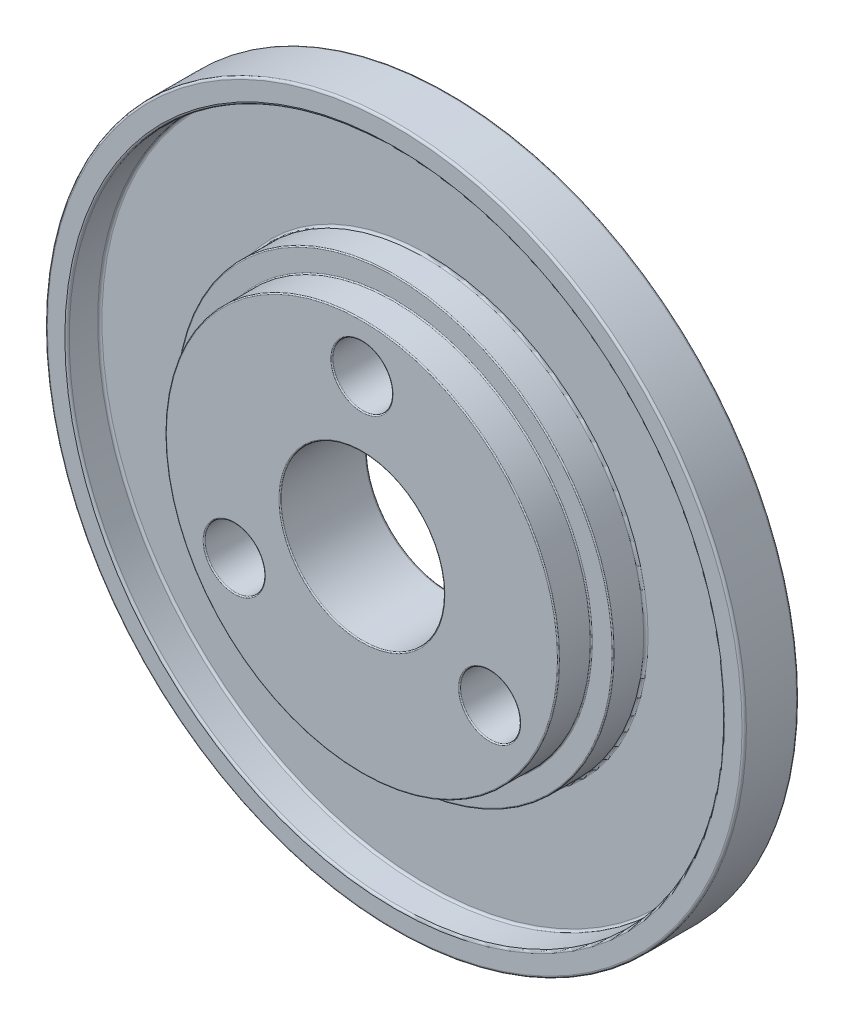
ISO-10303-21;
HEADER;
FILE_DESCRIPTION(('STEP AP214'),'2;1');
FILE_NAME('part.step','',(''),(''),'','','');
FILE_SCHEMA(('AUTOMOTIVE_DESIGN { 1 0 10303 214 1 1 1 1 }'));
ENDSEC;
DATA;
#1=APPLICATION_CONTEXT('core data for automotive mechanical design processes');
#2=APPLICATION_PROTOCOL_DEFINITION('international standard','automotive_design',2000,#1);
#3=PRODUCT_CONTEXT('',#1,'mechanical');
#4=PRODUCT('Part','Part','',(#3));
#5=PRODUCT_RELATED_PRODUCT_CATEGORY('part','',(#4));
#6=PRODUCT_DEFINITION_FORMATION('','',#4);
#7=PRODUCT_DEFINITION_CONTEXT('part definition',#1,'design');
#8=PRODUCT_DEFINITION('design','',#6,#7);
#9=PRODUCT_DEFINITION_SHAPE('','',#8);
#10=(LENGTH_UNIT() NAMED_UNIT(*) SI_UNIT(.MILLI.,.METRE.));
#11=(NAMED_UNIT(*) PLANE_ANGLE_UNIT() SI_UNIT($,.RADIAN.));
#12=(NAMED_UNIT(*) SI_UNIT($,.STERADIAN.) SOLID_ANGLE_UNIT());
#13=UNCERTAINTY_MEASURE_WITH_UNIT(LENGTH_MEASURE(1.E-05),#10,'distance_accuracy_value','');
#14=(GEOMETRIC_REPRESENTATION_CONTEXT(3) GLOBAL_UNCERTAINTY_ASSIGNED_CONTEXT((#13)) GLOBAL_UNIT_ASSIGNED_CONTEXT((#10,
#11,#12)) REPRESENTATION_CONTEXT('',''));
#15=CARTESIAN_POINT('',(0.,0.,0.));
#16=DIRECTION('',(0.,0.,1.));
#17=DIRECTION('',(1.,0.,0.));
#18=AXIS2_PLACEMENT_3D('',#15,#16,#17);
#19=CARTESIAN_POINT('',(0.,0.,0.));
#20=DIRECTION('',(0.,0.,1.));
#21=DIRECTION('',(1.,0.,0.));
#22=AXIS2_PLACEMENT_3D('',#19,#20,#21);
#23=PLANE('',#22);
#24=CARTESIAN_POINT('',(11.6913429510899,-6.75,0.));
#25=DIRECTION('',(0.,0.,-1.));
#26=DIRECTION('',(-1.,0.,0.));
#27=AXIS2_PLACEMENT_3D('',#24,#25,#26);
#28=CIRCLE('',#27,5.6);
#29=CARTESIAN_POINT('',(6.09134295108992,-6.75,0.));
#30=VERTEX_POINT('',#29);
#31=EDGE_CURVE('E131',#30,#30,#28,.T.);
#32=ORIENTED_EDGE('',*,*,#31,.F.);
#33=EDGE_LOOP('',(#32));
#34=FACE_BOUND('',#33,.T.);
#35=CARTESIAN_POINT('',(-11.6913429510899,-6.75,0.));
#36=DIRECTION('',(0.,0.,-1.));
#37=DIRECTION('',(-1.,0.,0.));
#38=AXIS2_PLACEMENT_3D('',#35,#36,#37);
#39=CIRCLE('',#38,5.6);
#40=CARTESIAN_POINT('',(-17.2913429510899,-6.75,0.));
#41=VERTEX_POINT('',#40);
#42=EDGE_CURVE('E125',#41,#41,#39,.T.);
#43=ORIENTED_EDGE('',*,*,#42,.F.);
#44=EDGE_LOOP('',(#43));
#45=FACE_BOUND('',#44,.T.);
#46=CARTESIAN_POINT('',(0.,0.,0.));
#47=DIRECTION('',(0.,0.,1.));
#48=DIRECTION('',(1.,0.,0.));
#49=AXIS2_PLACEMENT_3D('',#46,#47,#48);
#50=CIRCLE('',#49,31.8);
#51=CARTESIAN_POINT('',(31.8,0.,0.));
#52=VERTEX_POINT('',#51);
#53=EDGE_CURVE('E86',#52,#52,#50,.F.);
#54=ORIENTED_EDGE('',*,*,#53,.T.);
#55=EDGE_LOOP('',(#54));
#56=FACE_BOUND('',#55,.T.);
#57=CARTESIAN_POINT('',(0.,0.,0.));
#58=DIRECTION('',(0.,0.,1.));
#59=DIRECTION('',(1.,0.,0.));
#60=AXIS2_PLACEMENT_3D('',#57,#58,#59);
#61=CIRCLE('',#60,7.7);
#62=CARTESIAN_POINT('',(7.7,0.,0.));
#63=VERTEX_POINT('',#62);
#64=EDGE_CURVE('E83',#63,#63,#61,.T.);
#65=ORIENTED_EDGE('',*,*,#64,.T.);
#66=EDGE_LOOP('',(#65));
#67=FACE_BOUND('',#66,.T.);
#68=CARTESIAN_POINT('',(0.,13.5,0.));
#69=DIRECTION('',(0.,0.,-1.));
#70=DIRECTION('',(-1.,0.,0.));
#71=AXIS2_PLACEMENT_3D('',#68,#69,#70);
#72=CIRCLE('',#71,5.6);
#73=CARTESIAN_POINT('',(-5.6,13.5,0.));
#74=VERTEX_POINT('',#73);
#75=EDGE_CURVE('E119',#74,#74,#72,.T.);
#76=ORIENTED_EDGE('',*,*,#75,.F.);
#77=EDGE_LOOP('',(#76));
#78=FACE_BOUND('',#77,.T.);
#79=ADVANCED_FACE('F30',(#34,#45,#56,#67,#78),#23,.F.);
#80=CARTESIAN_POINT('',(0.,0.,5.));
#81=DIRECTION('',(0.,0.,1.));
#82=DIRECTION('',(1.,0.,0.));
#83=AXIS2_PLACEMENT_3D('',#80,#81,#82);
#84=PLANE('',#83);
#85=CARTESIAN_POINT('',(0.,0.,5.));
#86=DIRECTION('',(0.,0.,1.));
#87=DIRECTION('',(1.,0.,0.));
#88=AXIS2_PLACEMENT_3D('',#85,#86,#87);
#89=CIRCLE('',#88,19.9);
#90=CARTESIAN_POINT('',(19.9,0.,5.));
#91=VERTEX_POINT('',#90);
#92=EDGE_CURVE('E74',#91,#91,#89,.T.);
#93=ORIENTED_EDGE('',*,*,#92,.T.);
#94=EDGE_LOOP('',(#93));
#95=FACE_BOUND('',#94,.T.);
#96=CARTESIAN_POINT('',(0.,0.,5.));
#97=DIRECTION('',(0.,0.,1.));
#98=DIRECTION('',(1.,0.,0.));
#99=AXIS2_PLACEMENT_3D('',#96,#97,#98);
#100=CIRCLE('',#99,18.1);
#101=CARTESIAN_POINT('',(18.1,0.,5.));
#102=VERTEX_POINT('',#101);
#103=EDGE_CURVE('E77',#102,#102,#100,.F.);
#104=ORIENTED_EDGE('',*,*,#103,.T.);
#105=EDGE_LOOP('',(#104));
#106=FACE_BOUND('',#105,.T.);
#107=ADVANCED_FACE('F139',(#95,#106),#84,.T.);
#108=CARTESIAN_POINT('',(0.,0.,5.));
#109=DIRECTION('',(0.,0.,1.));
#110=DIRECTION('',(1.,0.,0.));
#111=AXIS2_PLACEMENT_3D('',#108,#109,#110);
#112=CIRCLE('',#111,31.8);
#113=CARTESIAN_POINT('',(31.8,0.,5.));
#114=VERTEX_POINT('',#113);
#115=EDGE_CURVE('E95',#114,#114,#112,.T.);
#116=ORIENTED_EDGE('',*,*,#115,.T.);
#117=EDGE_LOOP('',(#116));
#118=FACE_BOUND('',#117,.T.);
#119=CARTESIAN_POINT('',(0.,0.,5.));
#120=DIRECTION('',(0.,0.,1.));
#121=DIRECTION('',(1.,0.,0.));
#122=AXIS2_PLACEMENT_3D('',#119,#120,#121);
#123=CIRCLE('',#122,30.2);
#124=CARTESIAN_POINT('',(30.2,0.,5.));
#125=VERTEX_POINT('',#124);
#126=EDGE_CURVE('E98',#125,#125,#123,.F.);
#127=ORIENTED_EDGE('',*,*,#126,.T.);
#128=EDGE_LOOP('',(#127));
#129=FACE_BOUND('',#128,.T.);
#130=ADVANCED_FACE('F199',(#118,#129),#84,.T.);
#131=CARTESIAN_POINT('',(0.,0.,5.));
#132=DIRECTION('',(0.,0.,-1.));
#133=DIRECTION('',(-1.,0.,0.));
#134=AXIS2_PLACEMENT_3D('',#131,#132,#133);
#135=CYLINDRICAL_SURFACE('',#134,32.);
#136=CARTESIAN_POINT('',(0.,0.,4.8));
#137=DIRECTION('',(0.,0.,1.));
#138=DIRECTION('',(1.,0.,0.));
#139=AXIS2_PLACEMENT_3D('',#136,#137,#138);
#140=CIRCLE('',#139,32.);
#141=CARTESIAN_POINT('',(32.,0.,4.8));
#142=VERTEX_POINT('',#141);
#143=EDGE_CURVE('E89',#142,#142,#140,.F.);
#144=ORIENTED_EDGE('',*,*,#143,.T.);
#145=EDGE_LOOP('',(#144));
#146=FACE_BOUND('',#145,.T.);
#147=CARTESIAN_POINT('',(0.,0.,0.2));
#148=DIRECTION('',(0.,0.,1.));
#149=DIRECTION('',(1.,0.,0.));
#150=AXIS2_PLACEMENT_3D('',#147,#148,#149);
#151=CIRCLE('',#150,32.);
#152=CARTESIAN_POINT('',(32.,0.,0.2));
#153=VERTEX_POINT('',#152);
#154=EDGE_CURVE('E92',#153,#153,#151,.T.);
#155=ORIENTED_EDGE('',*,*,#154,.T.);
#156=EDGE_LOOP('',(#155));
#157=FACE_BOUND('',#156,.T.);
#158=ADVANCED_FACE('F198',(#146,#157),#135,.T.);
#159=CARTESIAN_POINT('',(0.,0.,5.));
#160=DIRECTION('',(0.,0.,-1.));
#161=DIRECTION('',(-1.,0.,0.));
#162=AXIS2_PLACEMENT_3D('',#159,#160,#161);
#163=CYLINDRICAL_SURFACE('',#162,7.5);
#164=CARTESIAN_POINT('',(0.,0.,7.9));
#165=DIRECTION('',(0.,0.,1.));
#166=DIRECTION('',(1.,0.,0.));
#167=AXIS2_PLACEMENT_3D('',#164,#165,#166);
#168=CIRCLE('',#167,7.5);
#169=CARTESIAN_POINT('',(7.5,0.,7.9));
#170=VERTEX_POINT('',#169);
#171=EDGE_CURVE('E10',#170,#170,#168,.T.);
#172=ORIENTED_EDGE('',*,*,#171,.T.);
#173=EDGE_LOOP('',(#172));
#174=FACE_BOUND('',#173,.T.);
#175=CARTESIAN_POINT('',(0.,0.,0.2));
#176=DIRECTION('',(0.,0.,1.));
#177=DIRECTION('',(1.,0.,0.));
#178=AXIS2_PLACEMENT_3D('',#175,#176,#177);
#179=CIRCLE('',#178,7.5);
#180=CARTESIAN_POINT('',(7.5,0.,0.2));
#181=VERTEX_POINT('',#180);
#182=EDGE_CURVE('E80',#181,#181,#179,.F.);
#183=ORIENTED_EDGE('',*,*,#182,.T.);
#184=EDGE_LOOP('',(#183));
#185=FACE_BOUND('',#184,.T.);
#186=ADVANCED_FACE('F194',(#174,#185),#163,.F.);
#187=CARTESIAN_POINT('',(0.,0.,2.));
#188=DIRECTION('',(0.,0.,1.));
#189=DIRECTION('',(1.,0.,0.));
#190=AXIS2_PLACEMENT_3D('',#187,#188,#189);
#191=CYLINDRICAL_SURFACE('',#190,30.);
#192=CARTESIAN_POINT('',(0.,0.,2.2));
#193=DIRECTION('',(0.,0.,1.));
#194=DIRECTION('',(1.,0.,0.));
#195=AXIS2_PLACEMENT_3D('',#192,#193,#194);
#196=CIRCLE('',#195,30.);
#197=CARTESIAN_POINT('',(30.,0.,2.2));
#198=VERTEX_POINT('',#197);
#199=EDGE_CURVE('E104',#198,#198,#196,.F.);
#200=ORIENTED_EDGE('',*,*,#199,.T.);
#201=EDGE_LOOP('',(#200));
#202=FACE_BOUND('',#201,.T.);
#203=CARTESIAN_POINT('',(0.,0.,4.8));
#204=DIRECTION('',(0.,0.,1.));
#205=DIRECTION('',(1.,0.,0.));
#206=AXIS2_PLACEMENT_3D('',#203,#204,#205);
#207=CIRCLE('',#206,30.);
#208=CARTESIAN_POINT('',(30.,0.,4.8));
#209=VERTEX_POINT('',#208);
#210=EDGE_CURVE('E107',#209,#209,#207,.T.);
#211=ORIENTED_EDGE('',*,*,#210,.T.);
#212=EDGE_LOOP('',(#211));
#213=FACE_BOUND('',#212,.T.);
#214=ADVANCED_FACE('F190',(#202,#213),#191,.F.);
#215=CARTESIAN_POINT('',(0.,0.,2.));
#216=DIRECTION('',(0.,0.,1.));
#217=DIRECTION('',(1.,0.,0.));
#218=AXIS2_PLACEMENT_3D('',#215,#216,#217);
#219=PLANE('',#218);
#220=CARTESIAN_POINT('',(0.,0.,2.));
#221=DIRECTION('',(0.,0.,1.));
#222=DIRECTION('',(1.,0.,0.));
#223=AXIS2_PLACEMENT_3D('',#220,#221,#222);
#224=CIRCLE('',#223,29.8);
#225=CARTESIAN_POINT('',(29.8,0.,2.));
#226=VERTEX_POINT('',#225);
#227=EDGE_CURVE('E110',#226,#226,#224,.T.);
#228=ORIENTED_EDGE('',*,*,#227,.T.);
#229=EDGE_LOOP('',(#228));
#230=FACE_BOUND('',#229,.T.);
#231=CARTESIAN_POINT('',(0.,0.,2.));
#232=DIRECTION('',(0.,0.,1.));
#233=DIRECTION('',(1.,0.,0.));
#234=AXIS2_PLACEMENT_3D('',#231,#232,#233);
#235=CIRCLE('',#234,20.2);
#236=CARTESIAN_POINT('',(20.2,0.,2.));
#237=VERTEX_POINT('',#236);
#238=EDGE_CURVE('E113',#237,#237,#235,.F.);
#239=ORIENTED_EDGE('',*,*,#238,.T.);
#240=EDGE_LOOP('',(#239));
#241=FACE_BOUND('',#240,.T.);
#242=ADVANCED_FACE('F186',(#230,#241),#219,.T.);
#243=CARTESIAN_POINT('',(0.,0.,2.));
#244=DIRECTION('',(0.,0.,1.));
#245=DIRECTION('',(1.,0.,0.));
#246=AXIS2_PLACEMENT_3D('',#243,#244,#245);
#247=CYLINDRICAL_SURFACE('',#246,20.);
#248=CARTESIAN_POINT('',(0.,0.,4.9));
#249=DIRECTION('',(0.,0.,1.));
#250=DIRECTION('',(1.,0.,0.));
#251=AXIS2_PLACEMENT_3D('',#248,#249,#250);
#252=CIRCLE('',#251,20.);
#253=CARTESIAN_POINT('',(20.,0.,4.9));
#254=VERTEX_POINT('',#253);
#255=EDGE_CURVE('E71',#254,#254,#252,.F.);
#256=ORIENTED_EDGE('',*,*,#255,.T.);
#257=EDGE_LOOP('',(#256));
#258=FACE_BOUND('',#257,.T.);
#259=CARTESIAN_POINT('',(0.,0.,2.2));
#260=DIRECTION('',(0.,0.,1.));
#261=DIRECTION('',(1.,0.,0.));
#262=AXIS2_PLACEMENT_3D('',#259,#260,#261);
#263=CIRCLE('',#262,20.);
#264=CARTESIAN_POINT('',(20.,0.,2.2));
#265=VERTEX_POINT('',#264);
#266=EDGE_CURVE('E101',#265,#265,#263,.T.);
#267=ORIENTED_EDGE('',*,*,#266,.T.);
#268=EDGE_LOOP('',(#267));
#269=FACE_BOUND('',#268,.T.);
#270=ADVANCED_FACE('F182',(#258,#269),#247,.T.);
#271=CARTESIAN_POINT('',(0.,0.,2.2));
#272=DIRECTION('',(0.,0.,1.));
#273=DIRECTION('',(1.,0.,0.));
#274=AXIS2_PLACEMENT_3D('',#271,#272,#273);
#275=TOROIDAL_SURFACE('',#274,29.8,0.2);
#276=ORIENTED_EDGE('',*,*,#199,.F.);
#277=EDGE_LOOP('',(#276));
#278=FACE_BOUND('',#277,.T.);
#279=ORIENTED_EDGE('',*,*,#227,.F.);
#280=EDGE_LOOP('',(#279));
#281=FACE_BOUND('',#280,.T.);
#282=ADVANCED_FACE('F185',(#278,#281),#275,.F.);
#283=CARTESIAN_POINT('',(0.,0.,2.2));
#284=DIRECTION('',(0.,0.,1.));
#285=DIRECTION('',(1.,0.,0.));
#286=AXIS2_PLACEMENT_3D('',#283,#284,#285);
#287=TOROIDAL_SURFACE('',#286,20.2,0.2);
#288=ORIENTED_EDGE('',*,*,#238,.F.);
#289=EDGE_LOOP('',(#288));
#290=FACE_BOUND('',#289,.T.);
#291=ORIENTED_EDGE('',*,*,#266,.F.);
#292=EDGE_LOOP('',(#291));
#293=FACE_BOUND('',#292,.T.);
#294=ADVANCED_FACE('F208',(#290,#293),#287,.F.);
#295=CARTESIAN_POINT('',(0.,0.,4.8));
#296=DIRECTION('',(0.,0.,1.));
#297=DIRECTION('',(1.,0.,0.));
#298=AXIS2_PLACEMENT_3D('',#295,#296,#297);
#299=TOROIDAL_SURFACE('',#298,31.8,0.2);
#300=ORIENTED_EDGE('',*,*,#143,.F.);
#301=EDGE_LOOP('',(#300));
#302=FACE_BOUND('',#301,.T.);
#303=ORIENTED_EDGE('',*,*,#115,.F.);
#304=EDGE_LOOP('',(#303));
#305=FACE_BOUND('',#304,.T.);
#306=ADVANCED_FACE('F212',(#302,#305),#299,.T.);
#307=CARTESIAN_POINT('',(0.,0.,4.8));
#308=DIRECTION('',(0.,0.,1.));
#309=DIRECTION('',(1.,0.,0.));
#310=AXIS2_PLACEMENT_3D('',#307,#308,#309);
#311=TOROIDAL_SURFACE('',#310,30.2,0.2);
#312=ORIENTED_EDGE('',*,*,#126,.F.);
#313=EDGE_LOOP('',(#312));
#314=FACE_BOUND('',#313,.T.);
#315=ORIENTED_EDGE('',*,*,#210,.F.);
#316=EDGE_LOOP('',(#315));
#317=FACE_BOUND('',#316,.T.);
#318=ADVANCED_FACE('F216',(#314,#317),#311,.T.);
#319=CARTESIAN_POINT('',(0.,0.,0.2));
#320=DIRECTION('',(0.,0.,1.));
#321=DIRECTION('',(1.,0.,0.));
#322=AXIS2_PLACEMENT_3D('',#319,#320,#321);
#323=TOROIDAL_SURFACE('',#322,7.7,0.2);
#324=ORIENTED_EDGE('',*,*,#182,.F.);
#325=EDGE_LOOP('',(#324));
#326=FACE_BOUND('',#325,.T.);
#327=ORIENTED_EDGE('',*,*,#64,.F.);
#328=EDGE_LOOP('',(#327));
#329=FACE_BOUND('',#328,.T.);
#330=ADVANCED_FACE('F220',(#326,#329),#323,.T.);
#331=CARTESIAN_POINT('',(0.,0.,0.2));
#332=DIRECTION('',(0.,0.,1.));
#333=DIRECTION('',(1.,0.,0.));
#334=AXIS2_PLACEMENT_3D('',#331,#332,#333);
#335=TOROIDAL_SURFACE('',#334,31.8,0.2);
#336=ORIENTED_EDGE('',*,*,#53,.F.);
#337=EDGE_LOOP('',(#336));
#338=FACE_BOUND('',#337,.T.);
#339=ORIENTED_EDGE('',*,*,#154,.F.);
#340=EDGE_LOOP('',(#339));
#341=FACE_BOUND('',#340,.T.);
#342=ADVANCED_FACE('F177',(#338,#341),#335,.T.);
#343=CARTESIAN_POINT('',(0.,0.,8.));
#344=DIRECTION('',(0.,0.,1.));
#345=DIRECTION('',(1.,0.,0.));
#346=AXIS2_PLACEMENT_3D('',#343,#344,#345);
#347=PLANE('',#346);
#348=CARTESIAN_POINT('',(0.,0.,8.));
#349=DIRECTION('',(0.,0.,1.));
#350=DIRECTION('',(1.,0.,0.));
#351=AXIS2_PLACEMENT_3D('',#348,#349,#350);
#352=CIRCLE('',#351,17.9);
#353=CARTESIAN_POINT('',(17.9,0.,8.));
#354=VERTEX_POINT('',#353);
#355=EDGE_CURVE('E50',#354,#354,#352,.T.);
#356=ORIENTED_EDGE('',*,*,#355,.T.);
#357=EDGE_LOOP('',(#356));
#358=FACE_BOUND('',#357,.T.);
#359=CARTESIAN_POINT('',(-11.6913429510899,-6.75,8.));
#360=DIRECTION('',(0.,0.,1.));
#361=DIRECTION('',(1.,0.,0.));
#362=AXIS2_PLACEMENT_3D('',#359,#360,#361);
#363=CIRCLE('',#362,2.85);
#364=CARTESIAN_POINT('',(-8.84134295108992,-6.75,8.));
#365=VERTEX_POINT('',#364);
#366=EDGE_CURVE('E53',#365,#365,#363,.F.);
#367=ORIENTED_EDGE('',*,*,#366,.T.);
#368=EDGE_LOOP('',(#367));
#369=FACE_BOUND('',#368,.T.);
#370=CARTESIAN_POINT('',(0.,13.5,8.));
#371=DIRECTION('',(0.,0.,1.));
#372=DIRECTION('',(1.,0.,0.));
#373=AXIS2_PLACEMENT_3D('',#370,#371,#372);
#374=CIRCLE('',#373,2.85);
#375=CARTESIAN_POINT('',(2.85,13.5,8.));
#376=VERTEX_POINT('',#375);
#377=EDGE_CURVE('E56',#376,#376,#374,.F.);
#378=ORIENTED_EDGE('',*,*,#377,.T.);
#379=EDGE_LOOP('',(#378));
#380=FACE_BOUND('',#379,.T.);
#381=CARTESIAN_POINT('',(11.6913429510899,-6.75,8.));
#382=DIRECTION('',(0.,0.,1.));
#383=DIRECTION('',(1.,0.,0.));
#384=AXIS2_PLACEMENT_3D('',#381,#382,#383);
#385=CIRCLE('',#384,2.85);
#386=CARTESIAN_POINT('',(14.5413429510899,-6.75,8.));
#387=VERTEX_POINT('',#386);
#388=EDGE_CURVE('E59',#387,#387,#385,.F.);
#389=ORIENTED_EDGE('',*,*,#388,.T.);
#390=EDGE_LOOP('',(#389));
#391=FACE_BOUND('',#390,.T.);
#392=CARTESIAN_POINT('',(0.,0.,8.));
#393=DIRECTION('',(0.,0.,1.));
#394=DIRECTION('',(1.,0.,0.));
#395=AXIS2_PLACEMENT_3D('',#392,#393,#394);
#396=CIRCLE('',#395,7.6);
#397=CARTESIAN_POINT('',(7.6,0.,8.));
#398=VERTEX_POINT('',#397);
#399=EDGE_CURVE('E62',#398,#398,#396,.F.);
#400=ORIENTED_EDGE('',*,*,#399,.T.);
#401=EDGE_LOOP('',(#400));
#402=FACE_BOUND('',#401,.T.);
#403=ADVANCED_FACE('F174',(#358,#369,#380,#391,#402),#347,.T.);
#404=CARTESIAN_POINT('',(0.,0.,8.));
#405=DIRECTION('',(0.,0.,-1.));
#406=DIRECTION('',(-1.,0.,0.));
#407=AXIS2_PLACEMENT_3D('',#404,#405,#406);
#408=CYLINDRICAL_SURFACE('',#407,18.);
#409=CARTESIAN_POINT('',(0.,0.,5.1));
#410=DIRECTION('',(0.,0.,1.));
#411=DIRECTION('',(1.,0.,0.));
#412=AXIS2_PLACEMENT_3D('',#409,#410,#411);
#413=CIRCLE('',#412,18.);
#414=CARTESIAN_POINT('',(18.,0.,5.1));
#415=VERTEX_POINT('',#414);
#416=EDGE_CURVE('E65',#415,#415,#413,.T.);
#417=ORIENTED_EDGE('',*,*,#416,.T.);
#418=EDGE_LOOP('',(#417));
#419=FACE_BOUND('',#418,.T.);
#420=CARTESIAN_POINT('',(0.,0.,7.9));
#421=DIRECTION('',(0.,0.,1.));
#422=DIRECTION('',(1.,0.,0.));
#423=AXIS2_PLACEMENT_3D('',#420,#421,#422);
#424=CIRCLE('',#423,18.);
#425=CARTESIAN_POINT('',(18.,0.,7.9));
#426=VERTEX_POINT('',#425);
#427=EDGE_CURVE('E68',#426,#426,#424,.F.);
#428=ORIENTED_EDGE('',*,*,#427,.T.);
#429=EDGE_LOOP('',(#428));
#430=FACE_BOUND('',#429,.T.);
#431=ADVANCED_FACE('F172',(#419,#430),#408,.T.);
#432=CARTESIAN_POINT('',(0.,13.5,-7.77817459305202));
#433=DIRECTION('',(0.,0.,1.));
#434=DIRECTION('',(1.,0.,0.));
#435=AXIS2_PLACEMENT_3D('',#432,#433,#434);
#436=CYLINDRICAL_SURFACE('',#435,2.75);
#437=CARTESIAN_POINT('',(0.,13.5,7.9));
#438=DIRECTION('',(0.,0.,1.));
#439=DIRECTION('',(1.,0.,0.));
#440=AXIS2_PLACEMENT_3D('',#437,#438,#439);
#441=CIRCLE('',#440,2.75);
#442=CARTESIAN_POINT('',(2.75,13.5,7.9));
#443=VERTEX_POINT('',#442);
#444=EDGE_CURVE('E41',#443,#443,#441,.T.);
#445=ORIENTED_EDGE('',*,*,#444,.T.);
#446=EDGE_LOOP('',(#445));
#447=FACE_BOUND('',#446,.T.);
#448=CARTESIAN_POINT('',(0.,13.5,2.84999999999999));
#449=DIRECTION('',(0.,0.,-1.));
#450=DIRECTION('',(-1.,0.,0.));
#451=AXIS2_PLACEMENT_3D('',#448,#449,#450);
#452=CIRCLE('',#451,2.74999999999999);
#453=CARTESIAN_POINT('',(-2.74999999999999,13.5,2.84999999999999));
#454=VERTEX_POINT('',#453);
#455=EDGE_CURVE('E116',#454,#454,#452,.T.);
#456=ORIENTED_EDGE('',*,*,#455,.T.);
#457=EDGE_LOOP('',(#456));
#458=FACE_BOUND('',#457,.T.);
#459=ADVANCED_FACE('F168',(#447,#458),#436,.F.);
#460=CARTESIAN_POINT('',(-11.6913429510899,-6.75,-7.77817459305202));
#461=DIRECTION('',(0.,0.,1.));
#462=DIRECTION('',(1.,0.,0.));
#463=AXIS2_PLACEMENT_3D('',#460,#461,#462);
#464=CYLINDRICAL_SURFACE('',#463,2.75);
#465=CARTESIAN_POINT('',(-11.6913429510899,-6.75,7.9));
#466=DIRECTION('',(0.,0.,1.));
#467=DIRECTION('',(1.,0.,0.));
#468=AXIS2_PLACEMENT_3D('',#465,#466,#467);
#469=CIRCLE('',#468,2.75);
#470=CARTESIAN_POINT('',(-8.94134295108992,-6.75,7.9));
#471=VERTEX_POINT('',#470);
#472=EDGE_CURVE('E45',#471,#471,#469,.T.);
#473=ORIENTED_EDGE('',*,*,#472,.T.);
#474=EDGE_LOOP('',(#473));
#475=FACE_BOUND('',#474,.T.);
#476=CARTESIAN_POINT('',(-11.6913429510899,-6.75,2.84999999999999));
#477=DIRECTION('',(0.,0.,-1.));
#478=DIRECTION('',(-1.,0.,0.));
#479=AXIS2_PLACEMENT_3D('',#476,#477,#478);
#480=CIRCLE('',#479,2.74999999999999);
#481=CARTESIAN_POINT('',(-14.4413429510899,-6.75,2.84999999999999));
#482=VERTEX_POINT('',#481);
#483=EDGE_CURVE('E122',#482,#482,#480,.T.);
#484=ORIENTED_EDGE('',*,*,#483,.T.);
#485=EDGE_LOOP('',(#484));
#486=FACE_BOUND('',#485,.T.);
#487=ADVANCED_FACE('F161',(#475,#486),#464,.F.);
#488=CARTESIAN_POINT('',(11.6913429510899,-6.75,-7.77817459305202));
#489=DIRECTION('',(0.,0.,1.));
#490=DIRECTION('',(1.,0.,0.));
#491=AXIS2_PLACEMENT_3D('',#488,#489,#490);
#492=CYLINDRICAL_SURFACE('',#491,2.75);
#493=CARTESIAN_POINT('',(11.6913429510899,-6.75,7.9));
#494=DIRECTION('',(0.,0.,1.));
#495=DIRECTION('',(1.,0.,0.));
#496=AXIS2_PLACEMENT_3D('',#493,#494,#495);
#497=CIRCLE('',#496,2.75);
#498=CARTESIAN_POINT('',(14.4413429510899,-6.75,7.9));
#499=VERTEX_POINT('',#498);
#500=EDGE_CURVE('E37',#499,#499,#497,.T.);
#501=ORIENTED_EDGE('',*,*,#500,.T.);
#502=EDGE_LOOP('',(#501));
#503=FACE_BOUND('',#502,.T.);
#504=CARTESIAN_POINT('',(11.6913429510899,-6.75,2.84999999999999));
#505=DIRECTION('',(0.,0.,-1.));
#506=DIRECTION('',(-1.,0.,0.));
#507=AXIS2_PLACEMENT_3D('',#504,#505,#506);
#508=CIRCLE('',#507,2.74999999999999);
#509=CARTESIAN_POINT('',(8.94134295108993,-6.75,2.84999999999999));
#510=VERTEX_POINT('',#509);
#511=EDGE_CURVE('E128',#510,#510,#508,.T.);
#512=ORIENTED_EDGE('',*,*,#511,.T.);
#513=EDGE_LOOP('',(#512));
#514=FACE_BOUND('',#513,.T.);
#515=ADVANCED_FACE('F152',(#503,#514),#492,.F.);
#516=CARTESIAN_POINT('',(0.,13.5,0.));
#517=DIRECTION('',(0.,0.,-1.));
#518=DIRECTION('',(-1.,0.,0.));
#519=AXIS2_PLACEMENT_3D('',#516,#517,#518);
#520=CONICAL_SURFACE('',#519,5.6,0.785398163397452);
#521=ORIENTED_EDGE('',*,*,#455,.F.);
#522=EDGE_LOOP('',(#521));
#523=FACE_BOUND('',#522,.T.);
#524=ORIENTED_EDGE('',*,*,#75,.T.);
#525=EDGE_LOOP('',(#524));
#526=FACE_BOUND('',#525,.T.);
#527=ADVANCED_FACE('F149',(#523,#526),#520,.F.);
#528=CARTESIAN_POINT('',(-11.6913429510899,-6.75,0.));
#529=DIRECTION('',(0.,0.,-1.));
#530=DIRECTION('',(-1.,0.,0.));
#531=AXIS2_PLACEMENT_3D('',#528,#529,#530);
#532=CONICAL_SURFACE('',#531,5.6,0.785398163397452);
#533=ORIENTED_EDGE('',*,*,#483,.F.);
#534=EDGE_LOOP('',(#533));
#535=FACE_BOUND('',#534,.T.);
#536=ORIENTED_EDGE('',*,*,#42,.T.);
#537=EDGE_LOOP('',(#536));
#538=FACE_BOUND('',#537,.T.);
#539=ADVANCED_FACE('F151',(#535,#538),#532,.F.);
#540=CARTESIAN_POINT('',(11.6913429510899,-6.75,0.));
#541=DIRECTION('',(0.,0.,-1.));
#542=DIRECTION('',(-1.,0.,0.));
#543=AXIS2_PLACEMENT_3D('',#540,#541,#542);
#544=CONICAL_SURFACE('',#543,5.6,0.785398163397452);
#545=ORIENTED_EDGE('',*,*,#511,.F.);
#546=EDGE_LOOP('',(#545));
#547=FACE_BOUND('',#546,.T.);
#548=ORIENTED_EDGE('',*,*,#31,.T.);
#549=EDGE_LOOP('',(#548));
#550=FACE_BOUND('',#549,.T.);
#551=ADVANCED_FACE('F135',(#547,#550),#544,.F.);
#552=CARTESIAN_POINT('',(0.,0.,4.9));
#553=DIRECTION('',(0.,0.,1.));
#554=DIRECTION('',(1.,0.,0.));
#555=AXIS2_PLACEMENT_3D('',#552,#553,#554);
#556=TOROIDAL_SURFACE('',#555,19.9,0.1);
#557=ORIENTED_EDGE('',*,*,#255,.F.);
#558=EDGE_LOOP('',(#557));
#559=FACE_BOUND('',#558,.T.);
#560=ORIENTED_EDGE('',*,*,#92,.F.);
#561=EDGE_LOOP('',(#560));
#562=FACE_BOUND('',#561,.T.);
#563=ADVANCED_FACE('F228',(#559,#562),#556,.T.);
#564=CARTESIAN_POINT('',(0.,0.,5.1));
#565=DIRECTION('',(0.,0.,1.));
#566=DIRECTION('',(1.,0.,0.));
#567=AXIS2_PLACEMENT_3D('',#564,#565,#566);
#568=TOROIDAL_SURFACE('',#567,18.1,0.1);
#569=ORIENTED_EDGE('',*,*,#103,.F.);
#570=EDGE_LOOP('',(#569));
#571=FACE_BOUND('',#570,.T.);
#572=ORIENTED_EDGE('',*,*,#416,.F.);
#573=EDGE_LOOP('',(#572));
#574=FACE_BOUND('',#573,.T.);
#575=ADVANCED_FACE('F231',(#571,#574),#568,.F.);
#576=CARTESIAN_POINT('',(0.,0.,7.9));
#577=DIRECTION('',(0.,0.,1.));
#578=DIRECTION('',(1.,0.,0.));
#579=AXIS2_PLACEMENT_3D('',#576,#577,#578);
#580=TOROIDAL_SURFACE('',#579,17.9,0.1);
#581=ORIENTED_EDGE('',*,*,#427,.F.);
#582=EDGE_LOOP('',(#581));
#583=FACE_BOUND('',#582,.T.);
#584=ORIENTED_EDGE('',*,*,#355,.F.);
#585=EDGE_LOOP('',(#584));
#586=FACE_BOUND('',#585,.T.);
#587=ADVANCED_FACE('F235',(#583,#586),#580,.T.);
#588=CARTESIAN_POINT('',(-11.6913429510899,-6.75,7.9));
#589=DIRECTION('',(0.,0.,1.));
#590=DIRECTION('',(1.,0.,0.));
#591=AXIS2_PLACEMENT_3D('',#588,#589,#590);
#592=TOROIDAL_SURFACE('',#591,2.85,0.1);
#593=ORIENTED_EDGE('',*,*,#366,.F.);
#594=EDGE_LOOP('',(#593));
#595=FACE_BOUND('',#594,.T.);
#596=ORIENTED_EDGE('',*,*,#472,.F.);
#597=EDGE_LOOP('',(#596));
#598=FACE_BOUND('',#597,.T.);
#599=ADVANCED_FACE('F239',(#595,#598),#592,.T.);
#600=CARTESIAN_POINT('',(0.,13.5,7.9));
#601=DIRECTION('',(0.,0.,1.));
#602=DIRECTION('',(1.,0.,0.));
#603=AXIS2_PLACEMENT_3D('',#600,#601,#602);
#604=TOROIDAL_SURFACE('',#603,2.85,0.1);
#605=ORIENTED_EDGE('',*,*,#377,.F.);
#606=EDGE_LOOP('',(#605));
#607=FACE_BOUND('',#606,.T.);
#608=ORIENTED_EDGE('',*,*,#444,.F.);
#609=EDGE_LOOP('',(#608));
#610=FACE_BOUND('',#609,.T.);
#611=ADVANCED_FACE('F243',(#607,#610),#604,.T.);
#612=CARTESIAN_POINT('',(11.6913429510899,-6.75,7.9));
#613=DIRECTION('',(0.,0.,1.));
#614=DIRECTION('',(1.,0.,0.));
#615=AXIS2_PLACEMENT_3D('',#612,#613,#614);
#616=TOROIDAL_SURFACE('',#615,2.85,0.1);
#617=ORIENTED_EDGE('',*,*,#388,.F.);
#618=EDGE_LOOP('',(#617));
#619=FACE_BOUND('',#618,.T.);
#620=ORIENTED_EDGE('',*,*,#500,.F.);
#621=EDGE_LOOP('',(#620));
#622=FACE_BOUND('',#621,.T.);
#623=ADVANCED_FACE('F246',(#619,#622),#616,.T.);
#624=CARTESIAN_POINT('',(0.,0.,7.9));
#625=DIRECTION('',(0.,0.,1.));
#626=DIRECTION('',(1.,0.,0.));
#627=AXIS2_PLACEMENT_3D('',#624,#625,#626);
#628=TOROIDAL_SURFACE('',#627,7.6,0.1);
#629=ORIENTED_EDGE('',*,*,#399,.F.);
#630=EDGE_LOOP('',(#629));
#631=FACE_BOUND('',#630,.T.);
#632=ORIENTED_EDGE('',*,*,#171,.F.);
#633=EDGE_LOOP('',(#632));
#634=FACE_BOUND('',#633,.T.);
#635=ADVANCED_FACE('F32',(#631,#634),#628,.T.);
#636=CLOSED_SHELL('',(#79,#107,#130,#158,#186,#214,#242,#270,#282,#294,#306,#318,#330,#342,#403,
#431,#459,#487,#515,#527,#539,#551,#563,#575,#587,#599,#611,#623,#635));
#637=MANIFOLD_SOLID_BREP('B2',#636);
#638=ADVANCED_BREP_SHAPE_REPRESENTATION('',(#18,#637),#14);
#639=SHAPE_DEFINITION_REPRESENTATION(#9,#638);
ENDSEC;
END-ISO-10303-21;
